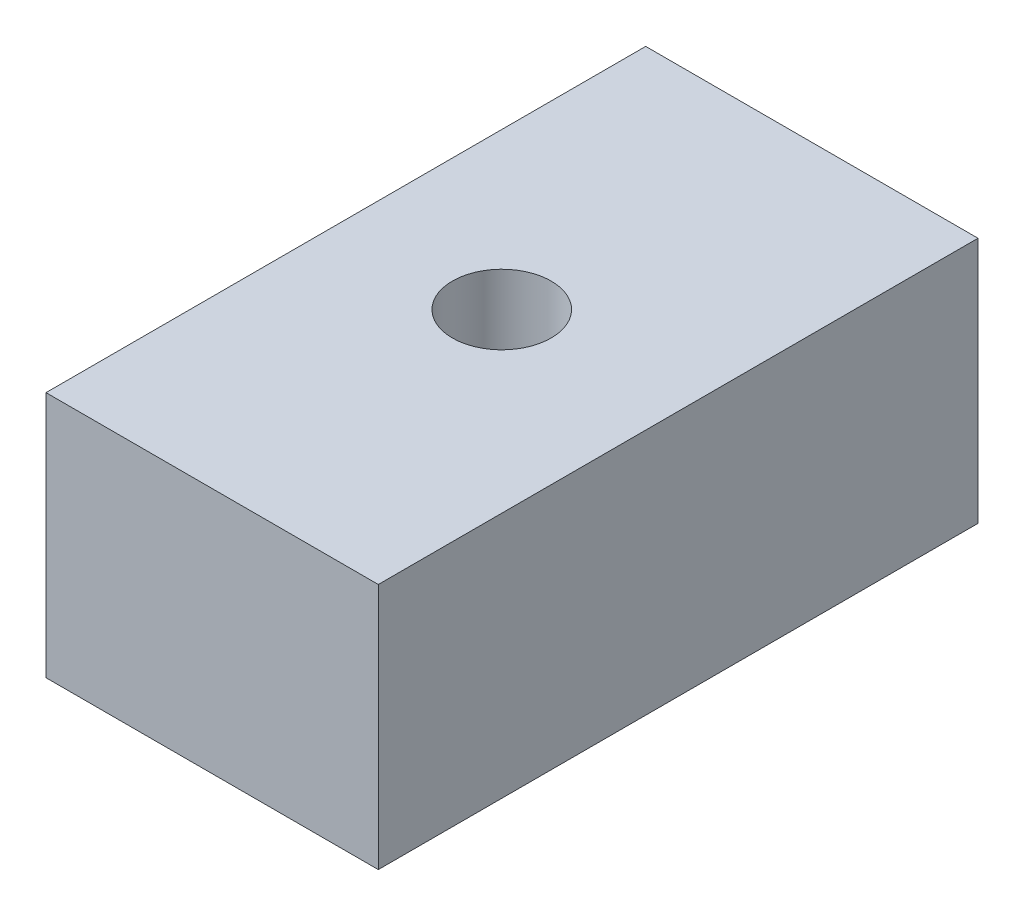
ISO-10303-21;
HEADER;
FILE_DESCRIPTION(('STEP AP214'),'2;1');
FILE_NAME('part.step','',(''),(''),'','','');
FILE_SCHEMA(('AUTOMOTIVE_DESIGN { 1 0 10303 214 1 1 1 1 }'));
ENDSEC;
DATA;
#1=APPLICATION_CONTEXT('core data for automotive mechanical design processes');
#2=APPLICATION_PROTOCOL_DEFINITION('international standard','automotive_design',2000,#1);
#3=PRODUCT_CONTEXT('',#1,'mechanical');
#4=PRODUCT('Part','Part','',(#3));
#5=PRODUCT_RELATED_PRODUCT_CATEGORY('part','',(#4));
#6=PRODUCT_DEFINITION_FORMATION('','',#4);
#7=PRODUCT_DEFINITION_CONTEXT('part definition',#1,'design');
#8=PRODUCT_DEFINITION('design','',#6,#7);
#9=PRODUCT_DEFINITION_SHAPE('','',#8);
#10=(LENGTH_UNIT() NAMED_UNIT(*) SI_UNIT(.MILLI.,.METRE.));
#11=(NAMED_UNIT(*) PLANE_ANGLE_UNIT() SI_UNIT($,.RADIAN.));
#12=(NAMED_UNIT(*) SI_UNIT($,.STERADIAN.) SOLID_ANGLE_UNIT());
#13=UNCERTAINTY_MEASURE_WITH_UNIT(LENGTH_MEASURE(1.E-05),#10,'distance_accuracy_value','');
#14=(GEOMETRIC_REPRESENTATION_CONTEXT(3) GLOBAL_UNCERTAINTY_ASSIGNED_CONTEXT((#13)) GLOBAL_UNIT_ASSIGNED_CONTEXT((#10,
#11,#12)) REPRESENTATION_CONTEXT('',''));
#15=CARTESIAN_POINT('',(0.,0.,0.));
#16=DIRECTION('',(0.,0.,1.));
#17=DIRECTION('',(1.,0.,0.));
#18=AXIS2_PLACEMENT_3D('',#15,#16,#17);
#19=CARTESIAN_POINT('',(0.,7.,-17.));
#20=DIRECTION('',(0.,-1.,0.));
#21=DIRECTION('',(0.,0.,-1.));
#22=AXIS2_PLACEMENT_3D('',#19,#20,#21);
#23=PLANE('',#22);
#24=DIRECTION('',(0.,0.,1.));
#25=VECTOR('',#24,1.);
#26=CARTESIAN_POINT('',(0.,7.,0.));
#27=LINE('',#26,#25);
#28=CARTESIAN_POINT('',(0.,7.,-17.));
#29=VERTEX_POINT('',#28);
#30=CARTESIAN_POINT('',(0.,7.,0.));
#31=VERTEX_POINT('',#30);
#32=EDGE_CURVE('E83',#29,#31,#27,.T.);
#33=ORIENTED_EDGE('',*,*,#32,.T.);
#34=DIRECTION('',(1.,0.,0.));
#35=VECTOR('',#34,1.);
#36=CARTESIAN_POINT('',(0.,7.,0.));
#37=LINE('',#36,#35);
#38=CARTESIAN_POINT('',(9.42,7.,0.));
#39=VERTEX_POINT('',#38);
#40=EDGE_CURVE('E78',#31,#39,#37,.T.);
#41=ORIENTED_EDGE('',*,*,#40,.T.);
#42=DIRECTION('',(0.,0.,-1.));
#43=VECTOR('',#42,1.);
#44=CARTESIAN_POINT('',(9.42,7.,0.));
#45=LINE('',#44,#43);
#46=CARTESIAN_POINT('',(9.42,7.,-17.));
#47=VERTEX_POINT('',#46);
#48=EDGE_CURVE('E81',#39,#47,#45,.T.);
#49=ORIENTED_EDGE('',*,*,#48,.T.);
#50=DIRECTION('',(-1.,0.,0.));
#51=VECTOR('',#50,1.);
#52=CARTESIAN_POINT('',(0.,7.,-17.));
#53=LINE('',#52,#51);
#54=EDGE_CURVE('E48',#47,#29,#53,.T.);
#55=ORIENTED_EDGE('',*,*,#54,.T.);
#56=EDGE_LOOP('',(#33,#41,#49,#55));
#57=FACE_BOUND('',#56,.T.);
#58=CARTESIAN_POINT('',(4.42,7.,-8.5));
#59=DIRECTION('',(0.,1.,0.));
#60=DIRECTION('',(0.,0.,1.));
#61=AXIS2_PLACEMENT_3D('',#58,#59,#60);
#62=CIRCLE('',#61,1.4);
#63=CARTESIAN_POINT('',(4.42,7.,-7.1));
#64=VERTEX_POINT('',#63);
#65=EDGE_CURVE('E98',#64,#64,#62,.T.);
#66=ORIENTED_EDGE('',*,*,#65,.F.);
#67=EDGE_LOOP('',(#66));
#68=FACE_BOUND('',#67,.T.);
#69=ADVANCED_FACE('F31',(#57,#68),#23,.F.);
#70=CARTESIAN_POINT('',(0.,0.,-17.));
#71=DIRECTION('',(0.,-1.,0.));
#72=DIRECTION('',(0.,0.,-1.));
#73=AXIS2_PLACEMENT_3D('',#70,#71,#72);
#74=PLANE('',#73);
#75=DIRECTION('',(0.,0.,1.));
#76=VECTOR('',#75,1.);
#77=CARTESIAN_POINT('',(0.,0.,0.));
#78=LINE('',#77,#76);
#79=CARTESIAN_POINT('',(0.,0.,-17.));
#80=VERTEX_POINT('',#79);
#81=CARTESIAN_POINT('',(0.,0.,0.));
#82=VERTEX_POINT('',#81);
#83=EDGE_CURVE('E95',#80,#82,#78,.T.);
#84=ORIENTED_EDGE('',*,*,#83,.F.);
#85=DIRECTION('',(-1.,0.,0.));
#86=VECTOR('',#85,1.);
#87=CARTESIAN_POINT('',(0.,0.,-17.));
#88=LINE('',#87,#86);
#89=CARTESIAN_POINT('',(9.42,0.,-17.));
#90=VERTEX_POINT('',#89);
#91=EDGE_CURVE('E71',#90,#80,#88,.T.);
#92=ORIENTED_EDGE('',*,*,#91,.F.);
#93=DIRECTION('',(0.,0.,-1.));
#94=VECTOR('',#93,1.);
#95=CARTESIAN_POINT('',(9.42,0.,0.));
#96=LINE('',#95,#94);
#97=CARTESIAN_POINT('',(9.42,0.,0.));
#98=VERTEX_POINT('',#97);
#99=EDGE_CURVE('E65',#98,#90,#96,.T.);
#100=ORIENTED_EDGE('',*,*,#99,.F.);
#101=DIRECTION('',(1.,0.,0.));
#102=VECTOR('',#101,1.);
#103=CARTESIAN_POINT('',(0.,0.,0.));
#104=LINE('',#103,#102);
#105=EDGE_CURVE('E87',#82,#98,#104,.T.);
#106=ORIENTED_EDGE('',*,*,#105,.F.);
#107=EDGE_LOOP('',(#84,#92,#100,#106));
#108=FACE_BOUND('',#107,.T.);
#109=CARTESIAN_POINT('',(4.42,0.,-8.5));
#110=DIRECTION('',(0.,1.,0.));
#111=DIRECTION('',(0.,0.,1.));
#112=AXIS2_PLACEMENT_3D('',#109,#110,#111);
#113=CIRCLE('',#112,1.4);
#114=CARTESIAN_POINT('',(4.42,0.,-7.1));
#115=VERTEX_POINT('',#114);
#116=EDGE_CURVE('E110',#115,#115,#113,.T.);
#117=ORIENTED_EDGE('',*,*,#116,.T.);
#118=EDGE_LOOP('',(#117));
#119=FACE_BOUND('',#118,.T.);
#120=ADVANCED_FACE('F106',(#108,#119),#74,.T.);
#121=CARTESIAN_POINT('',(0.,7.,0.));
#122=DIRECTION('',(1.,0.,0.));
#123=DIRECTION('',(0.,0.,-1.));
#124=AXIS2_PLACEMENT_3D('',#121,#122,#123);
#125=PLANE('',#124);
#126=ORIENTED_EDGE('',*,*,#83,.T.);
#127=DIRECTION('',(0.,-1.,0.));
#128=VECTOR('',#127,1.);
#129=CARTESIAN_POINT('',(0.,7.,0.));
#130=LINE('',#129,#128);
#131=EDGE_CURVE('E11',#31,#82,#130,.T.);
#132=ORIENTED_EDGE('',*,*,#131,.F.);
#133=ORIENTED_EDGE('',*,*,#32,.F.);
#134=DIRECTION('',(0.,-1.,0.));
#135=VECTOR('',#134,1.);
#136=CARTESIAN_POINT('',(0.,7.,-17.));
#137=LINE('',#136,#135);
#138=EDGE_CURVE('E91',#29,#80,#137,.T.);
#139=ORIENTED_EDGE('',*,*,#138,.T.);
#140=EDGE_LOOP('',(#126,#132,#133,#139));
#141=FACE_BOUND('',#140,.T.);
#142=ADVANCED_FACE('F33',(#141),#125,.F.);
#143=CARTESIAN_POINT('',(0.,7.,0.));
#144=DIRECTION('',(0.,0.,-1.));
#145=DIRECTION('',(-1.,0.,0.));
#146=AXIS2_PLACEMENT_3D('',#143,#144,#145);
#147=PLANE('',#146);
#148=ORIENTED_EDGE('',*,*,#105,.T.);
#149=DIRECTION('',(0.,-1.,0.));
#150=VECTOR('',#149,1.);
#151=CARTESIAN_POINT('',(9.42,7.,0.));
#152=LINE('',#151,#150);
#153=EDGE_CURVE('E40',#39,#98,#152,.T.);
#154=ORIENTED_EDGE('',*,*,#153,.F.);
#155=ORIENTED_EDGE('',*,*,#40,.F.);
#156=ORIENTED_EDGE('',*,*,#131,.T.);
#157=EDGE_LOOP('',(#148,#154,#155,#156));
#158=FACE_BOUND('',#157,.T.);
#159=ADVANCED_FACE('F86',(#158),#147,.F.);
#160=CARTESIAN_POINT('',(9.42,7.,0.));
#161=DIRECTION('',(-1.,0.,0.));
#162=DIRECTION('',(0.,0.,1.));
#163=AXIS2_PLACEMENT_3D('',#160,#161,#162);
#164=PLANE('',#163);
#165=ORIENTED_EDGE('',*,*,#99,.T.);
#166=DIRECTION('',(0.,-1.,0.));
#167=VECTOR('',#166,1.);
#168=CARTESIAN_POINT('',(9.42,7.,-17.));
#169=LINE('',#168,#167);
#170=EDGE_CURVE('E88',#47,#90,#169,.T.);
#171=ORIENTED_EDGE('',*,*,#170,.F.);
#172=ORIENTED_EDGE('',*,*,#48,.F.);
#173=ORIENTED_EDGE('',*,*,#153,.T.);
#174=EDGE_LOOP('',(#165,#171,#172,#173));
#175=FACE_BOUND('',#174,.T.);
#176=ADVANCED_FACE('F89',(#175),#164,.F.);
#177=CARTESIAN_POINT('',(0.,7.,-17.));
#178=DIRECTION('',(0.,0.,1.));
#179=DIRECTION('',(1.,0.,0.));
#180=AXIS2_PLACEMENT_3D('',#177,#178,#179);
#181=PLANE('',#180);
#182=ORIENTED_EDGE('',*,*,#91,.T.);
#183=ORIENTED_EDGE('',*,*,#138,.F.);
#184=ORIENTED_EDGE('',*,*,#54,.F.);
#185=ORIENTED_EDGE('',*,*,#170,.T.);
#186=EDGE_LOOP('',(#182,#183,#184,#185));
#187=FACE_BOUND('',#186,.T.);
#188=ADVANCED_FACE('F103',(#187),#181,.F.);
#189=CARTESIAN_POINT('',(4.42,7.,-8.5));
#190=DIRECTION('',(0.,-1.,0.));
#191=DIRECTION('',(0.,0.,-1.));
#192=AXIS2_PLACEMENT_3D('',#189,#190,#191);
#193=CYLINDRICAL_SURFACE('',#192,1.4);
#194=ORIENTED_EDGE('',*,*,#65,.T.);
#195=EDGE_LOOP('',(#194));
#196=FACE_BOUND('',#195,.T.);
#197=ORIENTED_EDGE('',*,*,#116,.F.);
#198=EDGE_LOOP('',(#197));
#199=FACE_BOUND('',#198,.T.);
#200=ADVANCED_FACE('F116',(#196,#199),#193,.F.);
#201=CLOSED_SHELL('',(#69,#120,#142,#159,#176,#188,#200));
#202=MANIFOLD_SOLID_BREP('B2',#201);
#203=ADVANCED_BREP_SHAPE_REPRESENTATION('',(#18,#202),#14);
#204=SHAPE_DEFINITION_REPRESENTATION(#9,#203);
ENDSEC;
END-ISO-10303-21;
